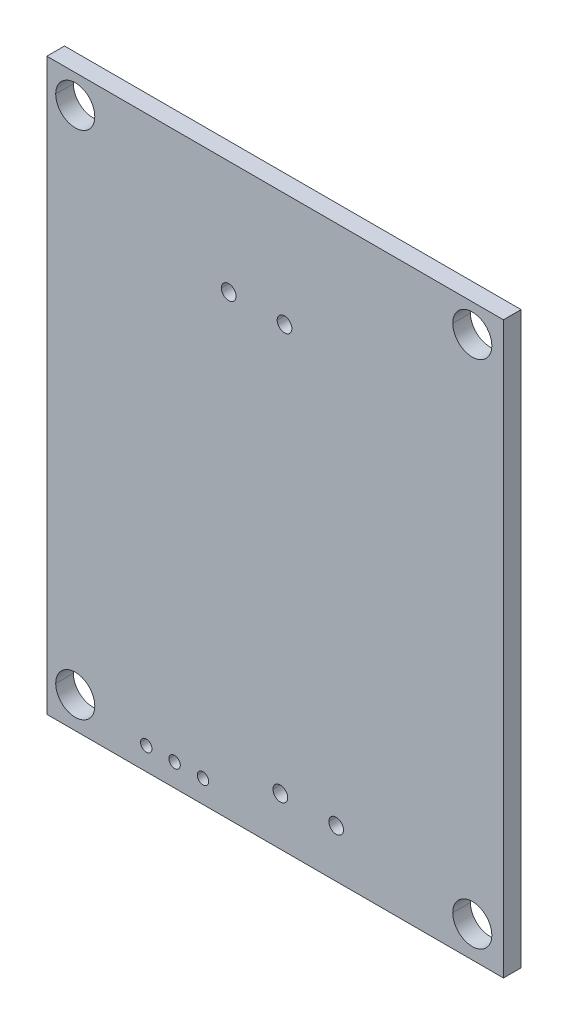
ISO-10303-21;
HEADER;
FILE_DESCRIPTION(('STEP AP214'),'2;1');
FILE_NAME('part.step','',(''),(''),'','','');
FILE_SCHEMA(('AUTOMOTIVE_DESIGN { 1 0 10303 214 1 1 1 1 }'));
ENDSEC;
DATA;
#1=APPLICATION_CONTEXT('core data for automotive mechanical design processes');
#2=APPLICATION_PROTOCOL_DEFINITION('international standard','automotive_design',2000,#1);
#3=PRODUCT_CONTEXT('',#1,'mechanical');
#4=PRODUCT('Part','Part','',(#3));
#5=PRODUCT_RELATED_PRODUCT_CATEGORY('part','',(#4));
#6=PRODUCT_DEFINITION_FORMATION('','',#4);
#7=PRODUCT_DEFINITION_CONTEXT('part definition',#1,'design');
#8=PRODUCT_DEFINITION('design','',#6,#7);
#9=PRODUCT_DEFINITION_SHAPE('','',#8);
#10=(LENGTH_UNIT() NAMED_UNIT(*) SI_UNIT(.MILLI.,.METRE.));
#11=(NAMED_UNIT(*) PLANE_ANGLE_UNIT() SI_UNIT($,.RADIAN.));
#12=(NAMED_UNIT(*) SI_UNIT($,.STERADIAN.) SOLID_ANGLE_UNIT());
#13=UNCERTAINTY_MEASURE_WITH_UNIT(LENGTH_MEASURE(1.E-05),#10,'distance_accuracy_value','');
#14=(GEOMETRIC_REPRESENTATION_CONTEXT(3) GLOBAL_UNCERTAINTY_ASSIGNED_CONTEXT((#13)) GLOBAL_UNIT_ASSIGNED_CONTEXT((#10,
#11,#12)) REPRESENTATION_CONTEXT('',''));
#15=CARTESIAN_POINT('',(0.,0.,0.));
#16=DIRECTION('',(0.,0.,1.));
#17=DIRECTION('',(1.,0.,0.));
#18=AXIS2_PLACEMENT_3D('',#15,#16,#17);
#19=CARTESIAN_POINT('',(151.878744279938,82.8420432923501,139.791582908599));
#20=DIRECTION('',(0.,0.,1.));
#21=DIRECTION('',(1.,0.,0.));
#22=AXIS2_PLACEMENT_3D('',#19,#20,#21);
#23=CYLINDRICAL_SURFACE('',#22,1.75);
#24=CARTESIAN_POINT('',(151.878744279938,82.8420432923501,140.581582908599));
#25=DIRECTION('',(0.,0.,1.));
#26=DIRECTION('',(1.,0.,0.));
#27=AXIS2_PLACEMENT_3D('',#24,#25,#26);
#28=CIRCLE('',#27,1.75);
#29=CARTESIAN_POINT('',(150.128744279938,82.8420432923501,140.581582908599));
#30=VERTEX_POINT('',#29);
#31=CARTESIAN_POINT('',(153.628744279938,82.8420432923501,140.581582908599));
#32=VERTEX_POINT('',#31);
#33=EDGE_CURVE('E67',#30,#32,#28,.T.);
#34=ORIENTED_EDGE('',*,*,#33,.F.);
#35=DIRECTION('',(0.,0.,1.));
#36=VECTOR('',#35,1.);
#37=CARTESIAN_POINT('',(150.128744279938,82.8420432923501,139.791582908599));
#38=LINE('',#37,#36);
#39=CARTESIAN_POINT('',(150.128744279938,82.8420432923501,142.161582908599));
#40=VERTEX_POINT('',#39);
#41=EDGE_CURVE('E11',#30,#40,#38,.T.);
#42=ORIENTED_EDGE('',*,*,#41,.T.);
#43=CARTESIAN_POINT('',(151.878744279938,82.8420432923501,142.161582908599));
#44=DIRECTION('',(0.,0.,1.));
#45=DIRECTION('',(1.,0.,0.));
#46=AXIS2_PLACEMENT_3D('',#43,#44,#45);
#47=CIRCLE('',#46,1.75);
#48=CARTESIAN_POINT('',(153.628744279938,82.8420432923501,142.161582908599));
#49=VERTEX_POINT('',#48);
#50=EDGE_CURVE('E55',#40,#49,#47,.T.);
#51=ORIENTED_EDGE('',*,*,#50,.T.);
#52=DIRECTION('',(0.,0.,1.));
#53=VECTOR('',#52,1.);
#54=CARTESIAN_POINT('',(153.628744279938,82.8420432923501,139.791582908599));
#55=LINE('',#54,#53);
#56=EDGE_CURVE('E481',#32,#49,#55,.T.);
#57=ORIENTED_EDGE('',*,*,#56,.F.);
#58=EDGE_LOOP('',(#34,#42,#51,#57));
#59=FACE_BOUND('',#58,.T.);
#60=ADVANCED_FACE('F44',(#59),#23,.F.);
#61=CARTESIAN_POINT('',(139.686744279938,84.3660432923501,139.791582908599));
#62=DIRECTION('',(0.,0.,1.));
#63=DIRECTION('',(1.,0.,0.));
#64=AXIS2_PLACEMENT_3D('',#61,#62,#63);
#65=CYLINDRICAL_SURFACE('',#64,0.66);
#66=CARTESIAN_POINT('',(139.686744279938,84.3660432923501,140.581582908599));
#67=DIRECTION('',(0.,0.,1.));
#68=DIRECTION('',(1.,0.,0.));
#69=AXIS2_PLACEMENT_3D('',#66,#67,#68);
#70=CIRCLE('',#69,0.66);
#71=CARTESIAN_POINT('',(139.026744279938,84.3660432923501,140.581582908599));
#72=VERTEX_POINT('',#71);
#73=CARTESIAN_POINT('',(140.346744279938,84.3660432923501,140.581582908599));
#74=VERTEX_POINT('',#73);
#75=EDGE_CURVE('E374',#72,#74,#70,.T.);
#76=ORIENTED_EDGE('',*,*,#75,.F.);
#77=DIRECTION('',(0.,0.,1.));
#78=VECTOR('',#77,1.);
#79=CARTESIAN_POINT('',(139.026744279938,84.3660432923501,139.791582908599));
#80=LINE('',#79,#78);
#81=CARTESIAN_POINT('',(139.026744279938,84.3660432923501,142.161582908599));
#82=VERTEX_POINT('',#81);
#83=EDGE_CURVE('E441',#72,#82,#80,.T.);
#84=ORIENTED_EDGE('',*,*,#83,.T.);
#85=CARTESIAN_POINT('',(139.686744279938,84.3660432923501,142.161582908599));
#86=DIRECTION('',(0.,0.,1.));
#87=DIRECTION('',(1.,0.,0.));
#88=AXIS2_PLACEMENT_3D('',#85,#86,#87);
#89=CIRCLE('',#88,0.66);
#90=CARTESIAN_POINT('',(140.346744279938,84.3660432923501,142.161582908599));
#91=VERTEX_POINT('',#90);
#92=EDGE_CURVE('E458',#82,#91,#89,.T.);
#93=ORIENTED_EDGE('',*,*,#92,.T.);
#94=DIRECTION('',(0.,0.,1.));
#95=VECTOR('',#94,1.);
#96=CARTESIAN_POINT('',(140.346744279938,84.3660432923501,139.791582908599));
#97=LINE('',#96,#95);
#98=EDGE_CURVE('E319',#74,#91,#97,.T.);
#99=ORIENTED_EDGE('',*,*,#98,.F.);
#100=EDGE_LOOP('',(#76,#84,#93,#99));
#101=FACE_BOUND('',#100,.T.);
#102=ADVANCED_FACE('F637',(#101),#65,.F.);
#103=CARTESIAN_POINT('',(134.686744279938,84.3660432923501,139.791582908599));
#104=DIRECTION('',(0.,0.,1.));
#105=DIRECTION('',(1.,0.,0.));
#106=AXIS2_PLACEMENT_3D('',#103,#104,#105);
#107=CYLINDRICAL_SURFACE('',#106,0.66);
#108=CARTESIAN_POINT('',(134.686744279938,84.3660432923501,140.581582908599));
#109=DIRECTION('',(0.,0.,1.));
#110=DIRECTION('',(1.,0.,0.));
#111=AXIS2_PLACEMENT_3D('',#108,#109,#110);
#112=CIRCLE('',#111,0.66);
#113=CARTESIAN_POINT('',(134.026744279938,84.3660432923501,140.581582908599));
#114=VERTEX_POINT('',#113);
#115=CARTESIAN_POINT('',(135.346744279938,84.3660432923501,140.581582908599));
#116=VERTEX_POINT('',#115);
#117=EDGE_CURVE('E450',#114,#116,#112,.T.);
#118=ORIENTED_EDGE('',*,*,#117,.F.);
#119=DIRECTION('',(0.,0.,1.));
#120=VECTOR('',#119,1.);
#121=CARTESIAN_POINT('',(134.026744279938,84.3660432923501,139.791582908599));
#122=LINE('',#121,#120);
#123=CARTESIAN_POINT('',(134.026744279938,84.3660432923501,142.161582908599));
#124=VERTEX_POINT('',#123);
#125=EDGE_CURVE('E414',#114,#124,#122,.T.);
#126=ORIENTED_EDGE('',*,*,#125,.T.);
#127=CARTESIAN_POINT('',(134.686744279938,84.3660432923501,142.161582908599));
#128=DIRECTION('',(0.,0.,1.));
#129=DIRECTION('',(1.,0.,0.));
#130=AXIS2_PLACEMENT_3D('',#127,#128,#129);
#131=CIRCLE('',#130,0.66);
#132=CARTESIAN_POINT('',(135.346744279938,84.3660432923501,142.161582908599));
#133=VERTEX_POINT('',#132);
#134=EDGE_CURVE('E410',#124,#133,#131,.T.);
#135=ORIENTED_EDGE('',*,*,#134,.T.);
#136=DIRECTION('',(0.,0.,1.));
#137=VECTOR('',#136,1.);
#138=CARTESIAN_POINT('',(135.346744279938,84.3660432923501,139.791582908599));
#139=LINE('',#138,#137);
#140=EDGE_CURVE('E318',#116,#133,#139,.T.);
#141=ORIENTED_EDGE('',*,*,#140,.F.);
#142=EDGE_LOOP('',(#118,#126,#135,#141));
#143=FACE_BOUND('',#142,.T.);
#144=ADVANCED_FACE('F628',(#143),#107,.F.);
#145=CARTESIAN_POINT('',(127.758744279938,82.0800432923501,139.791582908599));
#146=DIRECTION('',(0.,0.,1.));
#147=DIRECTION('',(1.,0.,0.));
#148=AXIS2_PLACEMENT_3D('',#145,#146,#147);
#149=CYLINDRICAL_SURFACE('',#148,0.51000000000001);
#150=CARTESIAN_POINT('',(127.758744279938,82.0800432923501,140.581582908599));
#151=DIRECTION('',(0.,0.,1.));
#152=DIRECTION('',(1.,0.,0.));
#153=AXIS2_PLACEMENT_3D('',#150,#151,#152);
#154=CIRCLE('',#153,0.51000000000001);
#155=CARTESIAN_POINT('',(127.248744279938,82.0800432923501,140.581582908599));
#156=VERTEX_POINT('',#155);
#157=CARTESIAN_POINT('',(128.268744279938,82.0800432923501,140.581582908599));
#158=VERTEX_POINT('',#157);
#159=EDGE_CURVE('E449',#156,#158,#154,.T.);
#160=ORIENTED_EDGE('',*,*,#159,.F.);
#161=DIRECTION('',(0.,0.,1.));
#162=VECTOR('',#161,1.);
#163=CARTESIAN_POINT('',(127.248744279938,82.0800432923501,139.791582908599));
#164=LINE('',#163,#162);
#165=CARTESIAN_POINT('',(127.248744279938,82.0800432923501,142.161582908599));
#166=VERTEX_POINT('',#165);
#167=EDGE_CURVE('E415',#156,#166,#164,.T.);
#168=ORIENTED_EDGE('',*,*,#167,.T.);
#169=CARTESIAN_POINT('',(127.758744279938,82.0800432923501,142.161582908599));
#170=DIRECTION('',(0.,0.,1.));
#171=DIRECTION('',(1.,0.,0.));
#172=AXIS2_PLACEMENT_3D('',#169,#170,#171);
#173=CIRCLE('',#172,0.51000000000001);
#174=CARTESIAN_POINT('',(128.268744279938,82.0800432923501,142.161582908599));
#175=VERTEX_POINT('',#174);
#176=EDGE_CURVE('E304',#166,#175,#173,.T.);
#177=ORIENTED_EDGE('',*,*,#176,.T.);
#178=DIRECTION('',(0.,0.,1.));
#179=VECTOR('',#178,1.);
#180=CARTESIAN_POINT('',(128.268744279938,82.0800432923501,139.791582908599));
#181=LINE('',#180,#179);
#182=EDGE_CURVE('E379',#158,#175,#181,.T.);
#183=ORIENTED_EDGE('',*,*,#182,.F.);
#184=EDGE_LOOP('',(#160,#168,#177,#183));
#185=FACE_BOUND('',#184,.T.);
#186=ADVANCED_FACE('F625',(#185),#149,.F.);
#187=CARTESIAN_POINT('',(125.218744279938,82.0800432923501,139.791582908599));
#188=DIRECTION('',(0.,0.,1.));
#189=DIRECTION('',(1.,0.,0.));
#190=AXIS2_PLACEMENT_3D('',#187,#188,#189);
#191=CYLINDRICAL_SURFACE('',#190,0.51000000000001);
#192=CARTESIAN_POINT('',(125.218744279938,82.0800432923501,140.581582908599));
#193=DIRECTION('',(0.,0.,1.));
#194=DIRECTION('',(1.,0.,0.));
#195=AXIS2_PLACEMENT_3D('',#192,#193,#194);
#196=CIRCLE('',#195,0.51000000000001);
#197=CARTESIAN_POINT('',(124.708744279938,82.0800432923501,140.581582908599));
#198=VERTEX_POINT('',#197);
#199=CARTESIAN_POINT('',(125.728744279938,82.0800432923501,140.581582908599));
#200=VERTEX_POINT('',#199);
#201=EDGE_CURVE('E419',#198,#200,#196,.T.);
#202=ORIENTED_EDGE('',*,*,#201,.F.);
#203=DIRECTION('',(0.,0.,1.));
#204=VECTOR('',#203,1.);
#205=CARTESIAN_POINT('',(124.708744279938,82.0800432923501,139.791582908599));
#206=LINE('',#205,#204);
#207=CARTESIAN_POINT('',(124.708744279938,82.0800432923501,142.161582908599));
#208=VERTEX_POINT('',#207);
#209=EDGE_CURVE('E301',#198,#208,#206,.T.);
#210=ORIENTED_EDGE('',*,*,#209,.T.);
#211=CARTESIAN_POINT('',(125.218744279938,82.0800432923501,142.161582908599));
#212=DIRECTION('',(0.,0.,1.));
#213=DIRECTION('',(1.,0.,0.));
#214=AXIS2_PLACEMENT_3D('',#211,#212,#213);
#215=CIRCLE('',#214,0.51000000000001);
#216=CARTESIAN_POINT('',(125.728744279938,82.0800432923501,142.161582908599));
#217=VERTEX_POINT('',#216);
#218=EDGE_CURVE('E305',#208,#217,#215,.T.);
#219=ORIENTED_EDGE('',*,*,#218,.T.);
#220=DIRECTION('',(0.,0.,1.));
#221=VECTOR('',#220,1.);
#222=CARTESIAN_POINT('',(125.728744279938,82.0800432923501,139.791582908599));
#223=LINE('',#222,#221);
#224=EDGE_CURVE('E330',#200,#217,#223,.T.);
#225=ORIENTED_EDGE('',*,*,#224,.F.);
#226=EDGE_LOOP('',(#202,#210,#219,#225));
#227=FACE_BOUND('',#226,.T.);
#228=ADVANCED_FACE('F627',(#227),#191,.F.);
#229=CARTESIAN_POINT('',(122.678744279938,82.0800432923501,139.791582908599));
#230=DIRECTION('',(0.,0.,1.));
#231=DIRECTION('',(1.,0.,0.));
#232=AXIS2_PLACEMENT_3D('',#229,#230,#231);
#233=CYLINDRICAL_SURFACE('',#232,0.51);
#234=CARTESIAN_POINT('',(122.678744279938,82.0800432923501,140.581582908599));
#235=DIRECTION('',(0.,0.,1.));
#236=DIRECTION('',(1.,0.,0.));
#237=AXIS2_PLACEMENT_3D('',#234,#235,#236);
#238=CIRCLE('',#237,0.51);
#239=CARTESIAN_POINT('',(122.168744279938,82.0800432923501,140.581582908599));
#240=VERTEX_POINT('',#239);
#241=CARTESIAN_POINT('',(123.188744279938,82.0800432923501,140.581582908599));
#242=VERTEX_POINT('',#241);
#243=EDGE_CURVE('E309',#240,#242,#238,.T.);
#244=ORIENTED_EDGE('',*,*,#243,.F.);
#245=DIRECTION('',(0.,0.,1.));
#246=VECTOR('',#245,1.);
#247=CARTESIAN_POINT('',(122.168744279938,82.0800432923501,139.791582908599));
#248=LINE('',#247,#246);
#249=CARTESIAN_POINT('',(122.168744279938,82.0800432923501,142.161582908599));
#250=VERTEX_POINT('',#249);
#251=EDGE_CURVE('E355',#240,#250,#248,.T.);
#252=ORIENTED_EDGE('',*,*,#251,.T.);
#253=CARTESIAN_POINT('',(122.678744279938,82.0800432923501,142.161582908599));
#254=DIRECTION('',(0.,0.,1.));
#255=DIRECTION('',(1.,0.,0.));
#256=AXIS2_PLACEMENT_3D('',#253,#254,#255);
#257=CIRCLE('',#256,0.51);
#258=CARTESIAN_POINT('',(123.188744279938,82.0800432923501,142.161582908599));
#259=VERTEX_POINT('',#258);
#260=EDGE_CURVE('E359',#250,#259,#257,.T.);
#261=ORIENTED_EDGE('',*,*,#260,.T.);
#262=DIRECTION('',(0.,0.,1.));
#263=VECTOR('',#262,1.);
#264=CARTESIAN_POINT('',(123.188744279938,82.0800432923501,139.791582908599));
#265=LINE('',#264,#263);
#266=EDGE_CURVE('E329',#242,#259,#265,.T.);
#267=ORIENTED_EDGE('',*,*,#266,.F.);
#268=EDGE_LOOP('',(#244,#252,#261,#267));
#269=FACE_BOUND('',#268,.T.);
#270=ADVANCED_FACE('F634',(#269),#233,.F.);
#271=CARTESIAN_POINT('',(116.318744279938,82.8420432923501,139.791582908599));
#272=DIRECTION('',(0.,0.,1.));
#273=DIRECTION('',(1.,0.,0.));
#274=AXIS2_PLACEMENT_3D('',#271,#272,#273);
#275=CYLINDRICAL_SURFACE('',#274,1.75);
#276=CARTESIAN_POINT('',(116.318744279938,82.8420432923501,140.581582908599));
#277=DIRECTION('',(0.,0.,1.));
#278=DIRECTION('',(1.,0.,0.));
#279=AXIS2_PLACEMENT_3D('',#276,#277,#278);
#280=CIRCLE('',#279,1.75);
#281=CARTESIAN_POINT('',(114.568744279938,82.8420432923501,140.581582908599));
#282=VERTEX_POINT('',#281);
#283=CARTESIAN_POINT('',(118.068744279938,82.8420432923501,140.581582908599));
#284=VERTEX_POINT('',#283);
#285=EDGE_CURVE('E416',#282,#284,#280,.T.);
#286=ORIENTED_EDGE('',*,*,#285,.F.);
#287=DIRECTION('',(0.,0.,1.));
#288=VECTOR('',#287,1.);
#289=CARTESIAN_POINT('',(114.568744279938,82.8420432923501,139.791582908599));
#290=LINE('',#289,#288);
#291=CARTESIAN_POINT('',(114.568744279938,82.8420432923501,142.161582908599));
#292=VERTEX_POINT('',#291);
#293=EDGE_CURVE('E406',#282,#292,#290,.T.);
#294=ORIENTED_EDGE('',*,*,#293,.T.);
#295=CARTESIAN_POINT('',(116.318744279938,82.8420432923501,142.161582908599));
#296=DIRECTION('',(0.,0.,1.));
#297=DIRECTION('',(1.,0.,0.));
#298=AXIS2_PLACEMENT_3D('',#295,#296,#297);
#299=CIRCLE('',#298,1.75);
#300=CARTESIAN_POINT('',(118.068744279938,82.8420432923501,142.161582908599));
#301=VERTEX_POINT('',#300);
#302=EDGE_CURVE('E285',#292,#301,#299,.T.);
#303=ORIENTED_EDGE('',*,*,#302,.T.);
#304=DIRECTION('',(0.,0.,1.));
#305=VECTOR('',#304,1.);
#306=CARTESIAN_POINT('',(118.068744279938,82.8420432923501,139.791582908599));
#307=LINE('',#306,#305);
#308=EDGE_CURVE('E308',#284,#301,#307,.T.);
#309=ORIENTED_EDGE('',*,*,#308,.F.);
#310=EDGE_LOOP('',(#286,#294,#303,#309));
#311=FACE_BOUND('',#310,.T.);
#312=ADVANCED_FACE('F662',(#311),#275,.F.);
#313=CARTESIAN_POINT('',(151.878744279938,128.56204329235,139.791582908599));
#314=DIRECTION('',(0.,0.,1.));
#315=DIRECTION('',(1.,0.,0.));
#316=AXIS2_PLACEMENT_3D('',#313,#314,#315);
#317=CYLINDRICAL_SURFACE('',#316,1.75);
#318=CARTESIAN_POINT('',(151.878744279938,128.56204329235,140.581582908599));
#319=DIRECTION('',(0.,0.,1.));
#320=DIRECTION('',(1.,0.,0.));
#321=AXIS2_PLACEMENT_3D('',#318,#319,#320);
#322=CIRCLE('',#321,1.75);
#323=CARTESIAN_POINT('',(150.128744279938,128.56204329235,140.581582908599));
#324=VERTEX_POINT('',#323);
#325=CARTESIAN_POINT('',(153.628744279938,128.56204329235,140.581582908599));
#326=VERTEX_POINT('',#325);
#327=EDGE_CURVE('E266',#324,#326,#322,.T.);
#328=ORIENTED_EDGE('',*,*,#327,.F.);
#329=DIRECTION('',(0.,0.,1.));
#330=VECTOR('',#329,1.);
#331=CARTESIAN_POINT('',(150.128744279938,128.56204329235,139.791582908599));
#332=LINE('',#331,#330);
#333=CARTESIAN_POINT('',(150.128744279938,128.56204329235,142.161582908599));
#334=VERTEX_POINT('',#333);
#335=EDGE_CURVE('E270',#324,#334,#332,.T.);
#336=ORIENTED_EDGE('',*,*,#335,.T.);
#337=CARTESIAN_POINT('',(151.878744279938,128.56204329235,142.161582908599));
#338=DIRECTION('',(0.,0.,1.));
#339=DIRECTION('',(1.,0.,0.));
#340=AXIS2_PLACEMENT_3D('',#337,#338,#339);
#341=CIRCLE('',#340,1.75);
#342=CARTESIAN_POINT('',(153.628744279938,128.56204329235,142.161582908599));
#343=VERTEX_POINT('',#342);
#344=EDGE_CURVE('E286',#334,#343,#341,.T.);
#345=ORIENTED_EDGE('',*,*,#344,.T.);
#346=DIRECTION('',(0.,0.,1.));
#347=VECTOR('',#346,1.);
#348=CARTESIAN_POINT('',(153.628744279938,128.56204329235,139.791582908599));
#349=LINE('',#348,#347);
#350=EDGE_CURVE('E272',#326,#343,#349,.T.);
#351=ORIENTED_EDGE('',*,*,#350,.F.);
#352=EDGE_LOOP('',(#328,#336,#345,#351));
#353=FACE_BOUND('',#352,.T.);
#354=ADVANCED_FACE('F268',(#353),#317,.F.);
#355=CARTESIAN_POINT('',(135.063744279938,120.94204329235,139.791582908599));
#356=DIRECTION('',(0.,0.,1.));
#357=DIRECTION('',(1.,0.,0.));
#358=AXIS2_PLACEMENT_3D('',#355,#356,#357);
#359=CYLINDRICAL_SURFACE('',#358,0.66);
#360=CARTESIAN_POINT('',(135.063744279938,120.94204329235,140.581582908599));
#361=DIRECTION('',(0.,0.,1.));
#362=DIRECTION('',(1.,0.,0.));
#363=AXIS2_PLACEMENT_3D('',#360,#361,#362);
#364=CIRCLE('',#363,0.66);
#365=CARTESIAN_POINT('',(134.403744279938,120.94204329235,140.581582908599));
#366=VERTEX_POINT('',#365);
#367=CARTESIAN_POINT('',(135.723744279938,120.94204329235,140.581582908599));
#368=VERTEX_POINT('',#367);
#369=EDGE_CURVE('E291',#366,#368,#364,.T.);
#370=ORIENTED_EDGE('',*,*,#369,.F.);
#371=DIRECTION('',(0.,0.,1.));
#372=VECTOR('',#371,1.);
#373=CARTESIAN_POINT('',(134.403744279938,120.94204329235,139.791582908599));
#374=LINE('',#373,#372);
#375=CARTESIAN_POINT('',(134.403744279938,120.94204329235,142.161582908599));
#376=VERTEX_POINT('',#375);
#377=EDGE_CURVE('E346',#366,#376,#374,.T.);
#378=ORIENTED_EDGE('',*,*,#377,.T.);
#379=CARTESIAN_POINT('',(135.063744279938,120.94204329235,142.161582908599));
#380=DIRECTION('',(0.,0.,1.));
#381=DIRECTION('',(1.,0.,0.));
#382=AXIS2_PLACEMENT_3D('',#379,#380,#381);
#383=CIRCLE('',#382,0.66);
#384=CARTESIAN_POINT('',(135.723744279938,120.94204329235,142.161582908599));
#385=VERTEX_POINT('',#384);
#386=EDGE_CURVE('E347',#376,#385,#383,.T.);
#387=ORIENTED_EDGE('',*,*,#386,.T.);
#388=DIRECTION('',(0.,0.,1.));
#389=VECTOR('',#388,1.);
#390=CARTESIAN_POINT('',(135.723744279938,120.94204329235,139.791582908599));
#391=LINE('',#390,#389);
#392=EDGE_CURVE('E423',#368,#385,#391,.T.);
#393=ORIENTED_EDGE('',*,*,#392,.F.);
#394=EDGE_LOOP('',(#370,#378,#387,#393));
#395=FACE_BOUND('',#394,.T.);
#396=ADVANCED_FACE('F568',(#395),#359,.F.);
#397=CARTESIAN_POINT('',(130.063744279938,120.94204329235,139.791582908599));
#398=DIRECTION('',(0.,0.,1.));
#399=DIRECTION('',(1.,0.,0.));
#400=AXIS2_PLACEMENT_3D('',#397,#398,#399);
#401=CYLINDRICAL_SURFACE('',#400,0.66);
#402=CARTESIAN_POINT('',(130.063744279938,120.94204329235,140.581582908599));
#403=DIRECTION('',(0.,0.,1.));
#404=DIRECTION('',(1.,0.,0.));
#405=AXIS2_PLACEMENT_3D('',#402,#403,#404);
#406=CIRCLE('',#405,0.66);
#407=CARTESIAN_POINT('',(129.403744279938,120.94204329235,140.581582908599));
#408=VERTEX_POINT('',#407);
#409=CARTESIAN_POINT('',(130.723744279938,120.94204329235,140.581582908599));
#410=VERTEX_POINT('',#409);
#411=EDGE_CURVE('E365',#408,#410,#406,.T.);
#412=ORIENTED_EDGE('',*,*,#411,.F.);
#413=DIRECTION('',(0.,0.,1.));
#414=VECTOR('',#413,1.);
#415=CARTESIAN_POINT('',(129.403744279938,120.94204329235,139.791582908599));
#416=LINE('',#415,#414);
#417=CARTESIAN_POINT('',(129.403744279938,120.94204329235,142.161582908599));
#418=VERTEX_POINT('',#417);
#419=EDGE_CURVE('E351',#408,#418,#416,.T.);
#420=ORIENTED_EDGE('',*,*,#419,.T.);
#421=CARTESIAN_POINT('',(130.063744279938,120.94204329235,142.161582908599));
#422=DIRECTION('',(0.,0.,1.));
#423=DIRECTION('',(1.,0.,0.));
#424=AXIS2_PLACEMENT_3D('',#421,#422,#423);
#425=CIRCLE('',#424,0.66);
#426=CARTESIAN_POINT('',(130.723744279938,120.94204329235,142.161582908599));
#427=VERTEX_POINT('',#426);
#428=EDGE_CURVE('E364',#418,#427,#425,.T.);
#429=ORIENTED_EDGE('',*,*,#428,.T.);
#430=DIRECTION('',(0.,0.,1.));
#431=VECTOR('',#430,1.);
#432=CARTESIAN_POINT('',(130.723744279938,120.94204329235,139.791582908599));
#433=LINE('',#432,#431);
#434=EDGE_CURVE('E383',#410,#427,#433,.T.);
#435=ORIENTED_EDGE('',*,*,#434,.F.);
#436=EDGE_LOOP('',(#412,#420,#429,#435));
#437=FACE_BOUND('',#436,.T.);
#438=ADVANCED_FACE('F556',(#437),#401,.F.);
#439=CARTESIAN_POINT('',(116.318744279938,128.56204329235,139.791582908599));
#440=DIRECTION('',(0.,0.,1.));
#441=DIRECTION('',(1.,0.,0.));
#442=AXIS2_PLACEMENT_3D('',#439,#440,#441);
#443=CYLINDRICAL_SURFACE('',#442,1.75);
#444=CARTESIAN_POINT('',(116.318744279938,128.56204329235,140.581582908599));
#445=DIRECTION('',(0.,0.,1.));
#446=DIRECTION('',(1.,0.,0.));
#447=AXIS2_PLACEMENT_3D('',#444,#445,#446);
#448=CIRCLE('',#447,1.75);
#449=CARTESIAN_POINT('',(114.568744279938,128.56204329235,140.581582908599));
#450=VERTEX_POINT('',#449);
#451=CARTESIAN_POINT('',(118.068744279938,128.56204329235,140.581582908599));
#452=VERTEX_POINT('',#451);
#453=EDGE_CURVE('E343',#450,#452,#448,.T.);
#454=ORIENTED_EDGE('',*,*,#453,.F.);
#455=DIRECTION('',(0.,0.,1.));
#456=VECTOR('',#455,1.);
#457=CARTESIAN_POINT('',(114.568744279938,128.56204329235,139.791582908599));
#458=LINE('',#457,#456);
#459=CARTESIAN_POINT('',(114.568744279938,128.56204329235,142.161582908599));
#460=VERTEX_POINT('',#459);
#461=EDGE_CURVE('E360',#450,#460,#458,.T.);
#462=ORIENTED_EDGE('',*,*,#461,.T.);
#463=CARTESIAN_POINT('',(116.318744279938,128.56204329235,142.161582908599));
#464=DIRECTION('',(0.,0.,1.));
#465=DIRECTION('',(1.,0.,0.));
#466=AXIS2_PLACEMENT_3D('',#463,#464,#465);
#467=CIRCLE('',#466,1.75);
#468=CARTESIAN_POINT('',(118.068744279938,128.56204329235,142.161582908599));
#469=VERTEX_POINT('',#468);
#470=EDGE_CURVE('E48',#460,#469,#467,.T.);
#471=ORIENTED_EDGE('',*,*,#470,.T.);
#472=DIRECTION('',(0.,0.,1.));
#473=VECTOR('',#472,1.);
#474=CARTESIAN_POINT('',(118.068744279938,128.56204329235,139.791582908599));
#475=LINE('',#474,#473);
#476=EDGE_CURVE('E402',#452,#469,#475,.T.);
#477=ORIENTED_EDGE('',*,*,#476,.F.);
#478=EDGE_LOOP('',(#454,#462,#471,#477));
#479=FACE_BOUND('',#478,.T.);
#480=ADVANCED_FACE('F803',(#479),#443,.F.);
#481=CARTESIAN_POINT('',(116.318744279938,128.56204329235,139.791582908599));
#482=DIRECTION('',(0.,0.,1.));
#483=DIRECTION('',(1.,0.,0.));
#484=AXIS2_PLACEMENT_3D('',#481,#482,#483);
#485=CYLINDRICAL_SURFACE('',#484,1.75);
#486=ORIENTED_EDGE('',*,*,#461,.F.);
#487=CARTESIAN_POINT('',(116.318744279938,128.56204329235,140.581582908599));
#488=DIRECTION('',(0.,0.,1.));
#489=DIRECTION('',(1.,0.,0.));
#490=AXIS2_PLACEMENT_3D('',#487,#488,#489);
#491=CIRCLE('',#490,1.75);
#492=EDGE_CURVE('E338',#452,#450,#491,.T.);
#493=ORIENTED_EDGE('',*,*,#492,.F.);
#494=ORIENTED_EDGE('',*,*,#476,.T.);
#495=CARTESIAN_POINT('',(116.318744279938,128.56204329235,142.161582908599));
#496=DIRECTION('',(0.,0.,1.));
#497=DIRECTION('',(1.,0.,0.));
#498=AXIS2_PLACEMENT_3D('',#495,#496,#497);
#499=CIRCLE('',#498,1.75);
#500=EDGE_CURVE('E386',#469,#460,#499,.T.);
#501=ORIENTED_EDGE('',*,*,#500,.T.);
#502=EDGE_LOOP('',(#486,#493,#494,#501));
#503=FACE_BOUND('',#502,.T.);
#504=ADVANCED_FACE('F653',(#503),#485,.F.);
#505=CARTESIAN_POINT('',(130.063744279938,120.94204329235,139.791582908599));
#506=DIRECTION('',(0.,0.,1.));
#507=DIRECTION('',(1.,0.,0.));
#508=AXIS2_PLACEMENT_3D('',#505,#506,#507);
#509=CYLINDRICAL_SURFACE('',#508,0.66);
#510=ORIENTED_EDGE('',*,*,#419,.F.);
#511=CARTESIAN_POINT('',(130.063744279938,120.94204329235,140.581582908599));
#512=DIRECTION('',(0.,0.,1.));
#513=DIRECTION('',(1.,0.,0.));
#514=AXIS2_PLACEMENT_3D('',#511,#512,#513);
#515=CIRCLE('',#514,0.66);
#516=EDGE_CURVE('E368',#410,#408,#515,.T.);
#517=ORIENTED_EDGE('',*,*,#516,.F.);
#518=ORIENTED_EDGE('',*,*,#434,.T.);
#519=CARTESIAN_POINT('',(130.063744279938,120.94204329235,142.161582908599));
#520=DIRECTION('',(0.,0.,1.));
#521=DIRECTION('',(1.,0.,0.));
#522=AXIS2_PLACEMENT_3D('',#519,#520,#521);
#523=CIRCLE('',#522,0.66);
#524=EDGE_CURVE('E387',#427,#418,#523,.T.);
#525=ORIENTED_EDGE('',*,*,#524,.T.);
#526=EDGE_LOOP('',(#510,#517,#518,#525));
#527=FACE_BOUND('',#526,.T.);
#528=ADVANCED_FACE('F549',(#527),#509,.F.);
#529=CARTESIAN_POINT('',(135.063744279938,120.94204329235,139.791582908599));
#530=DIRECTION('',(0.,0.,1.));
#531=DIRECTION('',(1.,0.,0.));
#532=AXIS2_PLACEMENT_3D('',#529,#530,#531);
#533=CYLINDRICAL_SURFACE('',#532,0.66);
#534=ORIENTED_EDGE('',*,*,#377,.F.);
#535=CARTESIAN_POINT('',(135.063744279938,120.94204329235,140.581582908599));
#536=DIRECTION('',(0.,0.,1.));
#537=DIRECTION('',(1.,0.,0.));
#538=AXIS2_PLACEMENT_3D('',#535,#536,#537);
#539=CIRCLE('',#538,0.66);
#540=EDGE_CURVE('E297',#368,#366,#539,.T.);
#541=ORIENTED_EDGE('',*,*,#540,.F.);
#542=ORIENTED_EDGE('',*,*,#392,.T.);
#543=CARTESIAN_POINT('',(135.063744279938,120.94204329235,142.161582908599));
#544=DIRECTION('',(0.,0.,1.));
#545=DIRECTION('',(1.,0.,0.));
#546=AXIS2_PLACEMENT_3D('',#543,#544,#545);
#547=CIRCLE('',#546,0.66);
#548=EDGE_CURVE('E398',#385,#376,#547,.T.);
#549=ORIENTED_EDGE('',*,*,#548,.T.);
#550=EDGE_LOOP('',(#534,#541,#542,#549));
#551=FACE_BOUND('',#550,.T.);
#552=ADVANCED_FACE('F565',(#551),#533,.F.);
#553=CARTESIAN_POINT('',(151.878744279938,128.56204329235,139.791582908599));
#554=DIRECTION('',(0.,0.,1.));
#555=DIRECTION('',(1.,0.,0.));
#556=AXIS2_PLACEMENT_3D('',#553,#554,#555);
#557=CYLINDRICAL_SURFACE('',#556,1.75);
#558=ORIENTED_EDGE('',*,*,#335,.F.);
#559=CARTESIAN_POINT('',(151.878744279938,128.56204329235,140.581582908599));
#560=DIRECTION('',(0.,0.,1.));
#561=DIRECTION('',(1.,0.,0.));
#562=AXIS2_PLACEMENT_3D('',#559,#560,#561);
#563=CIRCLE('',#562,1.75);
#564=EDGE_CURVE('E277',#326,#324,#563,.T.);
#565=ORIENTED_EDGE('',*,*,#564,.F.);
#566=ORIENTED_EDGE('',*,*,#350,.T.);
#567=CARTESIAN_POINT('',(151.878744279938,128.56204329235,142.161582908599));
#568=DIRECTION('',(0.,0.,1.));
#569=DIRECTION('',(1.,0.,0.));
#570=AXIS2_PLACEMENT_3D('',#567,#568,#569);
#571=CIRCLE('',#570,1.75);
#572=EDGE_CURVE('E283',#343,#334,#571,.T.);
#573=ORIENTED_EDGE('',*,*,#572,.T.);
#574=EDGE_LOOP('',(#558,#565,#566,#573));
#575=FACE_BOUND('',#574,.T.);
#576=ADVANCED_FACE('F281',(#575),#557,.F.);
#577=CARTESIAN_POINT('',(116.318744279938,82.8420432923501,139.791582908599));
#578=DIRECTION('',(0.,0.,1.));
#579=DIRECTION('',(1.,0.,0.));
#580=AXIS2_PLACEMENT_3D('',#577,#578,#579);
#581=CYLINDRICAL_SURFACE('',#580,1.75);
#582=ORIENTED_EDGE('',*,*,#293,.F.);
#583=CARTESIAN_POINT('',(116.318744279938,82.8420432923501,140.581582908599));
#584=DIRECTION('',(0.,0.,1.));
#585=DIRECTION('',(1.,0.,0.));
#586=AXIS2_PLACEMENT_3D('',#583,#584,#585);
#587=CIRCLE('',#586,1.75);
#588=EDGE_CURVE('E278',#284,#282,#587,.T.);
#589=ORIENTED_EDGE('',*,*,#588,.F.);
#590=ORIENTED_EDGE('',*,*,#308,.T.);
#591=CARTESIAN_POINT('',(116.318744279938,82.8420432923501,142.161582908599));
#592=DIRECTION('',(0.,0.,1.));
#593=DIRECTION('',(1.,0.,0.));
#594=AXIS2_PLACEMENT_3D('',#591,#592,#593);
#595=CIRCLE('',#594,1.75);
#596=EDGE_CURVE('E428',#301,#292,#595,.T.);
#597=ORIENTED_EDGE('',*,*,#596,.T.);
#598=EDGE_LOOP('',(#582,#589,#590,#597));
#599=FACE_BOUND('',#598,.T.);
#600=ADVANCED_FACE('F761',(#599),#581,.F.);
#601=CARTESIAN_POINT('',(122.678744279938,82.0800432923501,139.791582908599));
#602=DIRECTION('',(0.,0.,1.));
#603=DIRECTION('',(1.,0.,0.));
#604=AXIS2_PLACEMENT_3D('',#601,#602,#603);
#605=CYLINDRICAL_SURFACE('',#604,0.51);
#606=ORIENTED_EDGE('',*,*,#251,.F.);
#607=CARTESIAN_POINT('',(122.678744279938,82.0800432923501,140.581582908599));
#608=DIRECTION('',(0.,0.,1.));
#609=DIRECTION('',(1.,0.,0.));
#610=AXIS2_PLACEMENT_3D('',#607,#608,#609);
#611=CIRCLE('',#610,0.51);
#612=EDGE_CURVE('E312',#242,#240,#611,.T.);
#613=ORIENTED_EDGE('',*,*,#612,.F.);
#614=ORIENTED_EDGE('',*,*,#266,.T.);
#615=CARTESIAN_POINT('',(122.678744279938,82.0800432923501,142.161582908599));
#616=DIRECTION('',(0.,0.,1.));
#617=DIRECTION('',(1.,0.,0.));
#618=AXIS2_PLACEMENT_3D('',#615,#616,#617);
#619=CIRCLE('',#618,0.51);
#620=EDGE_CURVE('E326',#259,#250,#619,.T.);
#621=ORIENTED_EDGE('',*,*,#620,.T.);
#622=EDGE_LOOP('',(#606,#613,#614,#621));
#623=FACE_BOUND('',#622,.T.);
#624=ADVANCED_FACE('F748',(#623),#605,.F.);
#625=CARTESIAN_POINT('',(125.218744279938,82.0800432923501,139.791582908599));
#626=DIRECTION('',(0.,0.,1.));
#627=DIRECTION('',(1.,0.,0.));
#628=AXIS2_PLACEMENT_3D('',#625,#626,#627);
#629=CYLINDRICAL_SURFACE('',#628,0.51000000000001);
#630=ORIENTED_EDGE('',*,*,#209,.F.);
#631=CARTESIAN_POINT('',(125.218744279938,82.0800432923501,140.581582908599));
#632=DIRECTION('',(0.,0.,1.));
#633=DIRECTION('',(1.,0.,0.));
#634=AXIS2_PLACEMENT_3D('',#631,#632,#633);
#635=CIRCLE('',#634,0.51000000000001);
#636=EDGE_CURVE('E313',#200,#198,#635,.T.);
#637=ORIENTED_EDGE('',*,*,#636,.F.);
#638=ORIENTED_EDGE('',*,*,#224,.T.);
#639=CARTESIAN_POINT('',(125.218744279938,82.0800432923501,142.161582908599));
#640=DIRECTION('',(0.,0.,1.));
#641=DIRECTION('',(1.,0.,0.));
#642=AXIS2_PLACEMENT_3D('',#639,#640,#641);
#643=CIRCLE('',#642,0.51000000000001);
#644=EDGE_CURVE('E382',#217,#208,#643,.T.);
#645=ORIENTED_EDGE('',*,*,#644,.T.);
#646=EDGE_LOOP('',(#630,#637,#638,#645));
#647=FACE_BOUND('',#646,.T.);
#648=ADVANCED_FACE('F736',(#647),#629,.F.);
#649=CARTESIAN_POINT('',(127.758744279938,82.0800432923501,139.791582908599));
#650=DIRECTION('',(0.,0.,1.));
#651=DIRECTION('',(1.,0.,0.));
#652=AXIS2_PLACEMENT_3D('',#649,#650,#651);
#653=CYLINDRICAL_SURFACE('',#652,0.51000000000001);
#654=ORIENTED_EDGE('',*,*,#167,.F.);
#655=CARTESIAN_POINT('',(127.758744279938,82.0800432923501,140.581582908599));
#656=DIRECTION('',(0.,0.,1.));
#657=DIRECTION('',(1.,0.,0.));
#658=AXIS2_PLACEMENT_3D('',#655,#656,#657);
#659=CIRCLE('',#658,0.51000000000001);
#660=EDGE_CURVE('E422',#158,#156,#659,.T.);
#661=ORIENTED_EDGE('',*,*,#660,.F.);
#662=ORIENTED_EDGE('',*,*,#182,.T.);
#663=CARTESIAN_POINT('',(127.758744279938,82.0800432923501,142.161582908599));
#664=DIRECTION('',(0.,0.,1.));
#665=DIRECTION('',(1.,0.,0.));
#666=AXIS2_PLACEMENT_3D('',#663,#664,#665);
#667=CIRCLE('',#666,0.51000000000001);
#668=EDGE_CURVE('E354',#175,#166,#667,.T.);
#669=ORIENTED_EDGE('',*,*,#668,.T.);
#670=EDGE_LOOP('',(#654,#661,#662,#669));
#671=FACE_BOUND('',#670,.T.);
#672=ADVANCED_FACE('F623',(#671),#653,.F.);
#673=CARTESIAN_POINT('',(134.686744279938,84.3660432923501,139.791582908599));
#674=DIRECTION('',(0.,0.,1.));
#675=DIRECTION('',(1.,0.,0.));
#676=AXIS2_PLACEMENT_3D('',#673,#674,#675);
#677=CYLINDRICAL_SURFACE('',#676,0.66);
#678=ORIENTED_EDGE('',*,*,#125,.F.);
#679=CARTESIAN_POINT('',(134.686744279938,84.3660432923501,140.581582908599));
#680=DIRECTION('',(0.,0.,1.));
#681=DIRECTION('',(1.,0.,0.));
#682=AXIS2_PLACEMENT_3D('',#679,#680,#681);
#683=CIRCLE('',#682,0.66);
#684=EDGE_CURVE('E445',#116,#114,#683,.T.);
#685=ORIENTED_EDGE('',*,*,#684,.F.);
#686=ORIENTED_EDGE('',*,*,#140,.T.);
#687=CARTESIAN_POINT('',(134.686744279938,84.3660432923501,142.161582908599));
#688=DIRECTION('',(0.,0.,1.));
#689=DIRECTION('',(1.,0.,0.));
#690=AXIS2_PLACEMENT_3D('',#687,#688,#689);
#691=CIRCLE('',#690,0.66);
#692=EDGE_CURVE('E314',#133,#124,#691,.T.);
#693=ORIENTED_EDGE('',*,*,#692,.T.);
#694=EDGE_LOOP('',(#678,#685,#686,#693));
#695=FACE_BOUND('',#694,.T.);
#696=ADVANCED_FACE('F658',(#695),#677,.F.);
#697=CARTESIAN_POINT('',(139.686744279938,84.3660432923501,139.791582908599));
#698=DIRECTION('',(0.,0.,1.));
#699=DIRECTION('',(1.,0.,0.));
#700=AXIS2_PLACEMENT_3D('',#697,#698,#699);
#701=CYLINDRICAL_SURFACE('',#700,0.66);
#702=ORIENTED_EDGE('',*,*,#83,.F.);
#703=CARTESIAN_POINT('',(139.686744279938,84.3660432923501,140.581582908599));
#704=DIRECTION('',(0.,0.,1.));
#705=DIRECTION('',(1.,0.,0.));
#706=AXIS2_PLACEMENT_3D('',#703,#704,#705);
#707=CIRCLE('',#706,0.66);
#708=EDGE_CURVE('E377',#74,#72,#707,.T.);
#709=ORIENTED_EDGE('',*,*,#708,.F.);
#710=ORIENTED_EDGE('',*,*,#98,.T.);
#711=CARTESIAN_POINT('',(139.686744279938,84.3660432923501,142.161582908599));
#712=DIRECTION('',(0.,0.,1.));
#713=DIRECTION('',(1.,0.,0.));
#714=AXIS2_PLACEMENT_3D('',#711,#712,#713);
#715=CIRCLE('',#714,0.66);
#716=EDGE_CURVE('E371',#91,#82,#715,.T.);
#717=ORIENTED_EDGE('',*,*,#716,.T.);
#718=EDGE_LOOP('',(#702,#709,#710,#717));
#719=FACE_BOUND('',#718,.T.);
#720=ADVANCED_FACE('F656',(#719),#701,.F.);
#721=CARTESIAN_POINT('',(151.878744279938,82.8420432923501,139.791582908599));
#722=DIRECTION('',(0.,0.,1.));
#723=DIRECTION('',(1.,0.,0.));
#724=AXIS2_PLACEMENT_3D('',#721,#722,#723);
#725=CYLINDRICAL_SURFACE('',#724,1.75);
#726=ORIENTED_EDGE('',*,*,#41,.F.);
#727=CARTESIAN_POINT('',(151.878744279938,82.8420432923501,140.581582908599));
#728=DIRECTION('',(0.,0.,1.));
#729=DIRECTION('',(1.,0.,0.));
#730=AXIS2_PLACEMENT_3D('',#727,#728,#729);
#731=CIRCLE('',#730,1.75);
#732=EDGE_CURVE('E378',#32,#30,#731,.T.);
#733=ORIENTED_EDGE('',*,*,#732,.F.);
#734=ORIENTED_EDGE('',*,*,#56,.T.);
#735=CARTESIAN_POINT('',(151.878744279938,82.8420432923501,142.161582908599));
#736=DIRECTION('',(0.,0.,1.));
#737=DIRECTION('',(1.,0.,0.));
#738=AXIS2_PLACEMENT_3D('',#735,#736,#737);
#739=CIRCLE('',#738,1.75);
#740=EDGE_CURVE('E392',#49,#40,#739,.T.);
#741=ORIENTED_EDGE('',*,*,#740,.T.);
#742=EDGE_LOOP('',(#726,#733,#734,#741));
#743=FACE_BOUND('',#742,.T.);
#744=ADVANCED_FACE('F46',(#743),#725,.F.);
#745=CARTESIAN_POINT('',(113.778744279938,131.10204329235,140.581582908599));
#746=DIRECTION('',(0.,1.,0.));
#747=DIRECTION('',(1.,0.,0.));
#748=AXIS2_PLACEMENT_3D('',#745,#746,#747);
#749=PLANE('',#748);
#750=DIRECTION('',(0.,0.,1.));
#751=VECTOR('',#750,1.);
#752=CARTESIAN_POINT('',(113.778744279938,131.10204329235,140.581582908599));
#753=LINE('',#752,#751);
#754=CARTESIAN_POINT('',(113.778744279938,131.10204329235,140.581582908599));
#755=VERTEX_POINT('',#754);
#756=CARTESIAN_POINT('',(113.778744279938,131.10204329235,142.161582908599));
#757=VERTEX_POINT('',#756);
#758=EDGE_CURVE('E388',#755,#757,#753,.T.);
#759=ORIENTED_EDGE('',*,*,#758,.T.);
#760=DIRECTION('',(1.,0.,0.));
#761=VECTOR('',#760,1.);
#762=CARTESIAN_POINT('',(113.778744279938,131.10204329235,142.161582908599));
#763=LINE('',#762,#761);
#764=CARTESIAN_POINT('',(154.672744279938,131.10204329235,142.161582908599));
#765=VERTEX_POINT('',#764);
#766=EDGE_CURVE('E336',#757,#765,#763,.T.);
#767=ORIENTED_EDGE('',*,*,#766,.T.);
#768=DIRECTION('',(0.,0.,1.));
#769=VECTOR('',#768,1.);
#770=CARTESIAN_POINT('',(154.672744279938,131.10204329235,140.581582908599));
#771=LINE('',#770,#769);
#772=CARTESIAN_POINT('',(154.672744279938,131.10204329235,140.581582908599));
#773=VERTEX_POINT('',#772);
#774=EDGE_CURVE('E324',#773,#765,#771,.T.);
#775=ORIENTED_EDGE('',*,*,#774,.F.);
#776=DIRECTION('',(1.,0.,0.));
#777=VECTOR('',#776,1.);
#778=CARTESIAN_POINT('',(113.778744279938,131.10204329235,140.581582908599));
#779=LINE('',#778,#777);
#780=EDGE_CURVE('E454',#755,#773,#779,.T.);
#781=ORIENTED_EDGE('',*,*,#780,.F.);
#782=EDGE_LOOP('',(#759,#767,#775,#781));
#783=FACE_BOUND('',#782,.T.);
#784=ADVANCED_FACE('F506',(#783),#749,.T.);
#785=CARTESIAN_POINT('',(134.225744279938,105.57504329235,142.161582908599));
#786=DIRECTION('',(0.,0.,-1.));
#787=DIRECTION('',(0.,-1.,0.));
#788=AXIS2_PLACEMENT_3D('',#785,#786,#787);
#789=PLANE('',#788);
#790=DIRECTION('',(0.,-1.,0.));
#791=VECTOR('',#790,1.);
#792=CARTESIAN_POINT('',(154.672744279938,131.10204329235,142.161582908599));
#793=LINE('',#792,#791);
#794=CARTESIAN_POINT('',(154.672744279938,80.0480432923501,142.161582908599));
#795=VERTEX_POINT('',#794);
#796=EDGE_CURVE('E320',#765,#795,#793,.T.);
#797=ORIENTED_EDGE('',*,*,#796,.F.);
#798=ORIENTED_EDGE('',*,*,#766,.F.);
#799=DIRECTION('',(0.,1.,0.));
#800=VECTOR('',#799,1.);
#801=CARTESIAN_POINT('',(113.778744279938,80.0480432923501,142.161582908599));
#802=LINE('',#801,#800);
#803=CARTESIAN_POINT('',(113.778744279938,80.0480432923501,142.161582908599));
#804=VERTEX_POINT('',#803);
#805=EDGE_CURVE('E471',#804,#757,#802,.T.);
#806=ORIENTED_EDGE('',*,*,#805,.F.);
#807=DIRECTION('',(-1.,0.,0.));
#808=VECTOR('',#807,1.);
#809=CARTESIAN_POINT('',(154.672744279938,80.0480432923501,142.161582908599));
#810=LINE('',#809,#808);
#811=EDGE_CURVE('E393',#795,#804,#810,.T.);
#812=ORIENTED_EDGE('',*,*,#811,.F.);
#813=EDGE_LOOP('',(#797,#798,#806,#812));
#814=FACE_BOUND('',#813,.T.);
#815=ORIENTED_EDGE('',*,*,#500,.F.);
#816=ORIENTED_EDGE('',*,*,#470,.F.);
#817=EDGE_LOOP('',(#815,#816));
#818=FACE_BOUND('',#817,.T.);
#819=ORIENTED_EDGE('',*,*,#524,.F.);
#820=ORIENTED_EDGE('',*,*,#428,.F.);
#821=EDGE_LOOP('',(#819,#820));
#822=FACE_BOUND('',#821,.T.);
#823=ORIENTED_EDGE('',*,*,#548,.F.);
#824=ORIENTED_EDGE('',*,*,#386,.F.);
#825=EDGE_LOOP('',(#823,#824));
#826=FACE_BOUND('',#825,.T.);
#827=ORIENTED_EDGE('',*,*,#572,.F.);
#828=ORIENTED_EDGE('',*,*,#344,.F.);
#829=EDGE_LOOP('',(#827,#828));
#830=FACE_BOUND('',#829,.T.);
#831=ORIENTED_EDGE('',*,*,#596,.F.);
#832=ORIENTED_EDGE('',*,*,#302,.F.);
#833=EDGE_LOOP('',(#831,#832));
#834=FACE_BOUND('',#833,.T.);
#835=ORIENTED_EDGE('',*,*,#620,.F.);
#836=ORIENTED_EDGE('',*,*,#260,.F.);
#837=EDGE_LOOP('',(#835,#836));
#838=FACE_BOUND('',#837,.T.);
#839=ORIENTED_EDGE('',*,*,#644,.F.);
#840=ORIENTED_EDGE('',*,*,#218,.F.);
#841=EDGE_LOOP('',(#839,#840));
#842=FACE_BOUND('',#841,.T.);
#843=ORIENTED_EDGE('',*,*,#668,.F.);
#844=ORIENTED_EDGE('',*,*,#176,.F.);
#845=EDGE_LOOP('',(#843,#844));
#846=FACE_BOUND('',#845,.T.);
#847=ORIENTED_EDGE('',*,*,#692,.F.);
#848=ORIENTED_EDGE('',*,*,#134,.F.);
#849=EDGE_LOOP('',(#847,#848));
#850=FACE_BOUND('',#849,.T.);
#851=ORIENTED_EDGE('',*,*,#716,.F.);
#852=ORIENTED_EDGE('',*,*,#92,.F.);
#853=EDGE_LOOP('',(#851,#852));
#854=FACE_BOUND('',#853,.T.);
#855=ORIENTED_EDGE('',*,*,#740,.F.);
#856=ORIENTED_EDGE('',*,*,#50,.F.);
#857=EDGE_LOOP('',(#855,#856));
#858=FACE_BOUND('',#857,.T.);
#859=ADVANCED_FACE('F553',(#814,#818,#822,#826,#830,#834,#838,#842,#846,#850,#854,#858),#789,.F.);
#860=CARTESIAN_POINT('',(134.225744279938,105.57504329235,140.581582908599));
#861=DIRECTION('',(0.,0.,-1.));
#862=DIRECTION('',(0.,-1.,0.));
#863=AXIS2_PLACEMENT_3D('',#860,#861,#862);
#864=PLANE('',#863);
#865=DIRECTION('',(-1.,0.,0.));
#866=VECTOR('',#865,1.);
#867=CARTESIAN_POINT('',(154.672744279938,80.0480432923501,140.581582908599));
#868=LINE('',#867,#866);
#869=CARTESIAN_POINT('',(154.672744279938,80.0480432923501,140.581582908599));
#870=VERTEX_POINT('',#869);
#871=CARTESIAN_POINT('',(113.778744279938,80.0480432923501,140.581582908599));
#872=VERTEX_POINT('',#871);
#873=EDGE_CURVE('E332',#870,#872,#868,.T.);
#874=ORIENTED_EDGE('',*,*,#873,.T.);
#875=DIRECTION('',(0.,1.,0.));
#876=VECTOR('',#875,1.);
#877=CARTESIAN_POINT('',(113.778744279938,80.0480432923501,140.581582908599));
#878=LINE('',#877,#876);
#879=EDGE_CURVE('E337',#872,#755,#878,.T.);
#880=ORIENTED_EDGE('',*,*,#879,.T.);
#881=ORIENTED_EDGE('',*,*,#780,.T.);
#882=DIRECTION('',(0.,-1.,0.));
#883=VECTOR('',#882,1.);
#884=CARTESIAN_POINT('',(154.672744279938,131.10204329235,140.581582908599));
#885=LINE('',#884,#883);
#886=EDGE_CURVE('E342',#773,#870,#885,.T.);
#887=ORIENTED_EDGE('',*,*,#886,.T.);
#888=EDGE_LOOP('',(#874,#880,#881,#887));
#889=FACE_BOUND('',#888,.T.);
#890=ORIENTED_EDGE('',*,*,#492,.T.);
#891=ORIENTED_EDGE('',*,*,#453,.T.);
#892=EDGE_LOOP('',(#890,#891));
#893=FACE_BOUND('',#892,.T.);
#894=ORIENTED_EDGE('',*,*,#516,.T.);
#895=ORIENTED_EDGE('',*,*,#411,.T.);
#896=EDGE_LOOP('',(#894,#895));
#897=FACE_BOUND('',#896,.T.);
#898=ORIENTED_EDGE('',*,*,#540,.T.);
#899=ORIENTED_EDGE('',*,*,#369,.T.);
#900=EDGE_LOOP('',(#898,#899));
#901=FACE_BOUND('',#900,.T.);
#902=ORIENTED_EDGE('',*,*,#564,.T.);
#903=ORIENTED_EDGE('',*,*,#327,.T.);
#904=EDGE_LOOP('',(#902,#903));
#905=FACE_BOUND('',#904,.T.);
#906=ORIENTED_EDGE('',*,*,#588,.T.);
#907=ORIENTED_EDGE('',*,*,#285,.T.);
#908=EDGE_LOOP('',(#906,#907));
#909=FACE_BOUND('',#908,.T.);
#910=ORIENTED_EDGE('',*,*,#612,.T.);
#911=ORIENTED_EDGE('',*,*,#243,.T.);
#912=EDGE_LOOP('',(#910,#911));
#913=FACE_BOUND('',#912,.T.);
#914=ORIENTED_EDGE('',*,*,#636,.T.);
#915=ORIENTED_EDGE('',*,*,#201,.T.);
#916=EDGE_LOOP('',(#914,#915));
#917=FACE_BOUND('',#916,.T.);
#918=ORIENTED_EDGE('',*,*,#660,.T.);
#919=ORIENTED_EDGE('',*,*,#159,.T.);
#920=EDGE_LOOP('',(#918,#919));
#921=FACE_BOUND('',#920,.T.);
#922=ORIENTED_EDGE('',*,*,#684,.T.);
#923=ORIENTED_EDGE('',*,*,#117,.T.);
#924=EDGE_LOOP('',(#922,#923));
#925=FACE_BOUND('',#924,.T.);
#926=ORIENTED_EDGE('',*,*,#708,.T.);
#927=ORIENTED_EDGE('',*,*,#75,.T.);
#928=EDGE_LOOP('',(#926,#927));
#929=FACE_BOUND('',#928,.T.);
#930=ORIENTED_EDGE('',*,*,#732,.T.);
#931=ORIENTED_EDGE('',*,*,#33,.T.);
#932=EDGE_LOOP('',(#930,#931));
#933=FACE_BOUND('',#932,.T.);
#934=ADVANCED_FACE('F288',(#889,#893,#897,#901,#905,#909,#913,#917,#921,#925,#929,#933),#864,.T.);
#935=CARTESIAN_POINT('',(113.778744279938,80.0480432923501,140.581582908599));
#936=DIRECTION('',(-1.,0.,0.));
#937=DIRECTION('',(0.,0.,1.));
#938=AXIS2_PLACEMENT_3D('',#935,#936,#937);
#939=PLANE('',#938);
#940=DIRECTION('',(0.,0.,1.));
#941=VECTOR('',#940,1.);
#942=CARTESIAN_POINT('',(113.778744279938,80.0480432923501,140.581582908599));
#943=LINE('',#942,#941);
#944=EDGE_CURVE('E467',#872,#804,#943,.T.);
#945=ORIENTED_EDGE('',*,*,#944,.T.);
#946=ORIENTED_EDGE('',*,*,#805,.T.);
#947=ORIENTED_EDGE('',*,*,#758,.F.);
#948=ORIENTED_EDGE('',*,*,#879,.F.);
#949=EDGE_LOOP('',(#945,#946,#947,#948));
#950=FACE_BOUND('',#949,.T.);
#951=ADVANCED_FACE('F510',(#950),#939,.T.);
#952=CARTESIAN_POINT('',(154.672744279938,131.10204329235,140.581582908599));
#953=DIRECTION('',(1.,0.,0.));
#954=DIRECTION('',(0.,1.,0.));
#955=AXIS2_PLACEMENT_3D('',#952,#953,#954);
#956=PLANE('',#955);
#957=ORIENTED_EDGE('',*,*,#774,.T.);
#958=ORIENTED_EDGE('',*,*,#796,.T.);
#959=DIRECTION('',(0.,0.,1.));
#960=VECTOR('',#959,1.);
#961=CARTESIAN_POINT('',(154.672744279938,80.0480432923501,140.581582908599));
#962=LINE('',#961,#960);
#963=EDGE_CURVE('E325',#870,#795,#962,.T.);
#964=ORIENTED_EDGE('',*,*,#963,.F.);
#965=ORIENTED_EDGE('',*,*,#886,.F.);
#966=EDGE_LOOP('',(#957,#958,#964,#965));
#967=FACE_BOUND('',#966,.T.);
#968=ADVANCED_FACE('F498',(#967),#956,.T.);
#969=CARTESIAN_POINT('',(154.672744279938,80.0480432923501,140.581582908599));
#970=DIRECTION('',(0.,-1.,0.));
#971=DIRECTION('',(0.,0.,-1.));
#972=AXIS2_PLACEMENT_3D('',#969,#970,#971);
#973=PLANE('',#972);
#974=ORIENTED_EDGE('',*,*,#963,.T.);
#975=ORIENTED_EDGE('',*,*,#811,.T.);
#976=ORIENTED_EDGE('',*,*,#944,.F.);
#977=ORIENTED_EDGE('',*,*,#873,.F.);
#978=EDGE_LOOP('',(#974,#975,#976,#977));
#979=FACE_BOUND('',#978,.T.);
#980=ADVANCED_FACE('F493',(#979),#973,.T.);
#981=CLOSED_SHELL('',(#60,#102,#144,#186,#228,#270,#312,#354,#396,#438,#480,#504,#528,#552,#576,
#600,#624,#648,#672,#696,#720,#744,#784,#859,#934,#951,#968,#980));
#982=MANIFOLD_SOLID_BREP('B2',#981);
#983=ADVANCED_BREP_SHAPE_REPRESENTATION('',(#18,#982),#14);
#984=SHAPE_DEFINITION_REPRESENTATION(#9,#983);
ENDSEC;
END-ISO-10303-21;
